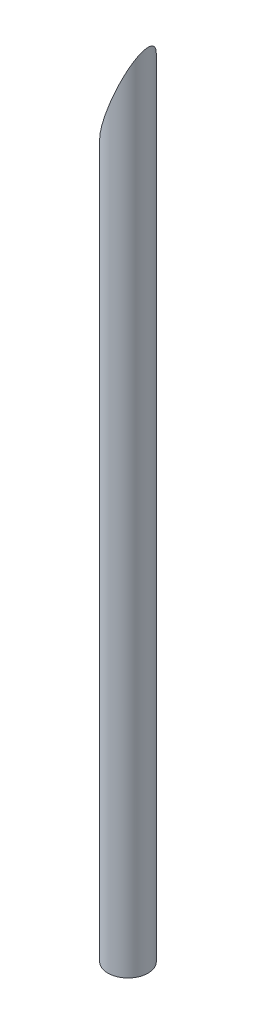
ISO-10303-21;
HEADER;
FILE_DESCRIPTION(('STEP AP214'),'2;1');
FILE_NAME('part.step','',(''),(''),'','','');
FILE_SCHEMA(('AUTOMOTIVE_DESIGN { 1 0 10303 214 1 1 1 1 }'));
ENDSEC;
DATA;
#1=APPLICATION_CONTEXT('core data for automotive mechanical design processes');
#2=APPLICATION_PROTOCOL_DEFINITION('international standard','automotive_design',2000,#1);
#3=PRODUCT_CONTEXT('',#1,'mechanical');
#4=PRODUCT('Part','Part','',(#3));
#5=PRODUCT_RELATED_PRODUCT_CATEGORY('part','',(#4));
#6=PRODUCT_DEFINITION_FORMATION('','',#4);
#7=PRODUCT_DEFINITION_CONTEXT('part definition',#1,'design');
#8=PRODUCT_DEFINITION('design','',#6,#7);
#9=PRODUCT_DEFINITION_SHAPE('','',#8);
#10=(LENGTH_UNIT() NAMED_UNIT(*) SI_UNIT(.MILLI.,.METRE.));
#11=(NAMED_UNIT(*) PLANE_ANGLE_UNIT() SI_UNIT($,.RADIAN.));
#12=(NAMED_UNIT(*) SI_UNIT($,.STERADIAN.) SOLID_ANGLE_UNIT());
#13=UNCERTAINTY_MEASURE_WITH_UNIT(LENGTH_MEASURE(1.E-05),#10,'distance_accuracy_value','');
#14=(GEOMETRIC_REPRESENTATION_CONTEXT(3) GLOBAL_UNCERTAINTY_ASSIGNED_CONTEXT((#13)) GLOBAL_UNIT_ASSIGNED_CONTEXT((#10,
#11,#12)) REPRESENTATION_CONTEXT('',''));
#15=CARTESIAN_POINT('',(0.,0.,0.));
#16=DIRECTION('',(0.,0.,1.));
#17=DIRECTION('',(1.,0.,0.));
#18=AXIS2_PLACEMENT_3D('',#15,#16,#17);
#19=CARTESIAN_POINT('',(0.,6.,0.));
#20=DIRECTION('',(0.,-1.,0.));
#21=DIRECTION('',(0.,0.,-1.));
#22=AXIS2_PLACEMENT_3D('',#19,#20,#21);
#23=CYLINDRICAL_SURFACE('',#22,0.15);
#24=CARTESIAN_POINT('',(0.,5.60948113901155,0.));
#25=DIRECTION('',(0.93350534582222,-0.358563480183549,0.));
#26=DIRECTION('',(-0.358563480183549,-0.93350534582222,0.));
#27=AXIS2_PLACEMENT_3D('',#24,#25,#26);
#28=ELLIPSE('',#27,0.418335966404651,0.15);
#29=CARTESIAN_POINT('',(-0.15,5.21896227802311,0.));
#30=VERTEX_POINT('',#29);
#31=EDGE_CURVE('E38',#30,#30,#28,.T.);
#32=ORIENTED_EDGE('',*,*,#31,.T.);
#33=EDGE_LOOP('',(#32));
#34=FACE_BOUND('',#33,.T.);
#35=CARTESIAN_POINT('',(0.,0.,0.));
#36=DIRECTION('',(0.,1.,0.));
#37=DIRECTION('',(0.,0.,1.));
#38=AXIS2_PLACEMENT_3D('',#35,#36,#37);
#39=CIRCLE('',#38,0.15);
#40=CARTESIAN_POINT('',(0.,0.,0.15));
#41=VERTEX_POINT('',#40);
#42=EDGE_CURVE('E10',#41,#41,#39,.T.);
#43=ORIENTED_EDGE('',*,*,#42,.T.);
#44=EDGE_LOOP('',(#43));
#45=FACE_BOUND('',#44,.T.);
#46=ADVANCED_FACE('F32',(#34,#45),#23,.T.);
#47=CARTESIAN_POINT('',(0.,0.,0.));
#48=DIRECTION('',(0.,1.,0.));
#49=DIRECTION('',(0.,0.,1.));
#50=AXIS2_PLACEMENT_3D('',#47,#48,#49);
#51=PLANE('',#50);
#52=ORIENTED_EDGE('',*,*,#42,.F.);
#53=EDGE_LOOP('',(#52));
#54=FACE_BOUND('',#53,.T.);
#55=ADVANCED_FACE('F47',(#54),#51,.F.);
#56=CARTESIAN_POINT('',(0.15,6.,-3.));
#57=DIRECTION('',(0.93350534582222,-0.358563480183549,0.));
#58=DIRECTION('',(0.358563480183549,0.93350534582222,0.));
#59=AXIS2_PLACEMENT_3D('',#56,#57,#58);
#60=PLANE('',#59);
#61=ORIENTED_EDGE('',*,*,#31,.F.);
#62=EDGE_LOOP('',(#61));
#63=FACE_BOUND('',#62,.T.);
#64=ADVANCED_FACE('F45',(#63),#60,.F.);
#65=CLOSED_SHELL('',(#46,#55,#64));
#66=MANIFOLD_SOLID_BREP('B2',#65);
#67=ADVANCED_BREP_SHAPE_REPRESENTATION('',(#18,#66),#14);
#68=SHAPE_DEFINITION_REPRESENTATION(#9,#67);
ENDSEC;
END-ISO-10303-21;
